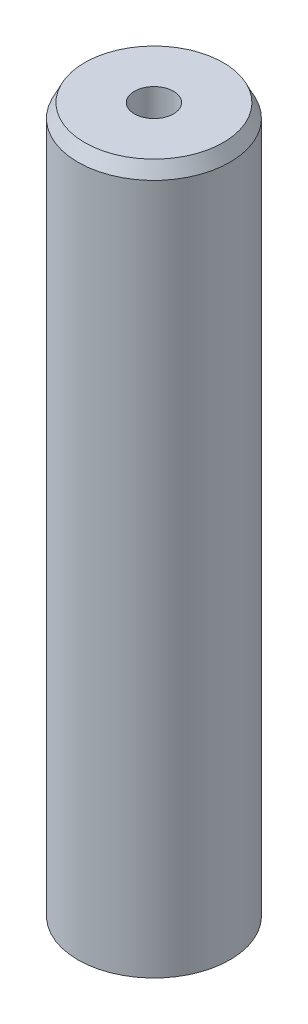
ISO-10303-21;
HEADER;
FILE_DESCRIPTION(('STEP AP214'),'2;1');
FILE_NAME('part.step','',(''),(''),'','','');
FILE_SCHEMA(('AUTOMOTIVE_DESIGN { 1 0 10303 214 1 1 1 1 }'));
ENDSEC;
DATA;
#1=APPLICATION_CONTEXT('core data for automotive mechanical design processes');
#2=APPLICATION_PROTOCOL_DEFINITION('international standard','automotive_design',2000,#1);
#3=PRODUCT_CONTEXT('',#1,'mechanical');
#4=PRODUCT('Part','Part','',(#3));
#5=PRODUCT_RELATED_PRODUCT_CATEGORY('part','',(#4));
#6=PRODUCT_DEFINITION_FORMATION('','',#4);
#7=PRODUCT_DEFINITION_CONTEXT('part definition',#1,'design');
#8=PRODUCT_DEFINITION('design','',#6,#7);
#9=PRODUCT_DEFINITION_SHAPE('','',#8);
#10=(LENGTH_UNIT() NAMED_UNIT(*) SI_UNIT(.MILLI.,.METRE.));
#11=(NAMED_UNIT(*) PLANE_ANGLE_UNIT() SI_UNIT($,.RADIAN.));
#12=(NAMED_UNIT(*) SI_UNIT($,.STERADIAN.) SOLID_ANGLE_UNIT());
#13=UNCERTAINTY_MEASURE_WITH_UNIT(LENGTH_MEASURE(1.E-05),#10,'distance_accuracy_value','');
#14=(GEOMETRIC_REPRESENTATION_CONTEXT(3) GLOBAL_UNCERTAINTY_ASSIGNED_CONTEXT((#13)) GLOBAL_UNIT_ASSIGNED_CONTEXT((#10,
#11,#12)) REPRESENTATION_CONTEXT('',''));
#15=CARTESIAN_POINT('',(0.,0.,0.));
#16=DIRECTION('',(0.,0.,1.));
#17=DIRECTION('',(1.,0.,0.));
#18=AXIS2_PLACEMENT_3D('',#15,#16,#17);
#19=CARTESIAN_POINT('',(0.,93.5188679575843,0.));
#20=DIRECTION('',(0.,-1.,0.));
#21=DIRECTION('',(0.,0.,-1.));
#22=AXIS2_PLACEMENT_3D('',#19,#20,#21);
#23=CYLINDRICAL_SURFACE('',#22,10.);
#24=CARTESIAN_POINT('',(0.,91.723650856446,0.));
#25=DIRECTION('',(0.,1.,0.));
#26=DIRECTION('',(0.,0.,1.));
#27=AXIS2_PLACEMENT_3D('',#24,#25,#26);
#28=CIRCLE('',#27,10.);
#29=CARTESIAN_POINT('',(0.,91.723650856446,10.));
#30=VERTEX_POINT('',#29);
#31=EDGE_CURVE('E50',#30,#30,#28,.F.);
#32=ORIENTED_EDGE('',*,*,#31,.T.);
#33=EDGE_LOOP('',(#32));
#34=FACE_BOUND('',#33,.T.);
#35=CARTESIAN_POINT('',(0.,0.887262560043039,0.));
#36=DIRECTION('',(0.,1.,0.));
#37=DIRECTION('',(0.,0.,1.));
#38=AXIS2_PLACEMENT_3D('',#35,#36,#37);
#39=CIRCLE('',#38,10.);
#40=CARTESIAN_POINT('',(0.,0.887262560043039,10.));
#41=VERTEX_POINT('',#40);
#42=EDGE_CURVE('E51',#41,#41,#39,.T.);
#43=ORIENTED_EDGE('',*,*,#42,.T.);
#44=EDGE_LOOP('',(#43));
#45=FACE_BOUND('',#44,.T.);
#46=ADVANCED_FACE('F39',(#34,#45),#23,.T.);
#47=CARTESIAN_POINT('',(0.,93.5188679575843,0.));
#48=DIRECTION('',(0.,1.,0.));
#49=DIRECTION('',(0.,0.,1.));
#50=AXIS2_PLACEMENT_3D('',#47,#48,#49);
#51=PLANE('',#50);
#52=CARTESIAN_POINT('',(0.,93.5188679575843,0.));
#53=DIRECTION('',(0.,1.,0.));
#54=DIRECTION('',(0.,0.,1.));
#55=AXIS2_PLACEMENT_3D('',#52,#53,#54);
#56=CIRCLE('',#55,9.11273743995698);
#57=CARTESIAN_POINT('',(0.,93.5188679575843,9.11273743995698));
#58=VERTEX_POINT('',#57);
#59=EDGE_CURVE('E54',#58,#58,#56,.T.);
#60=ORIENTED_EDGE('',*,*,#59,.T.);
#61=EDGE_LOOP('',(#60));
#62=FACE_BOUND('',#61,.T.);
#63=CARTESIAN_POINT('',(0.,93.5188679575843,0.));
#64=DIRECTION('',(0.,1.,0.));
#65=DIRECTION('',(0.,0.,1.));
#66=AXIS2_PLACEMENT_3D('',#63,#64,#65);
#67=CIRCLE('',#66,2.57745682731033);
#68=CARTESIAN_POINT('',(0.,93.5188679575843,2.57745682731033));
#69=VERTEX_POINT('',#68);
#70=EDGE_CURVE('E58',#69,#69,#67,.T.);
#71=ORIENTED_EDGE('',*,*,#70,.F.);
#72=EDGE_LOOP('',(#71));
#73=FACE_BOUND('',#72,.T.);
#74=ADVANCED_FACE('F69',(#62,#73),#51,.T.);
#75=CARTESIAN_POINT('',(0.,0.,0.));
#76=DIRECTION('',(0.,1.,0.));
#77=DIRECTION('',(0.,0.,1.));
#78=AXIS2_PLACEMENT_3D('',#75,#76,#77);
#79=PLANE('',#78);
#80=CARTESIAN_POINT('',(0.,0.,0.));
#81=DIRECTION('',(0.,1.,0.));
#82=DIRECTION('',(0.,0.,1.));
#83=AXIS2_PLACEMENT_3D('',#80,#81,#82);
#84=CIRCLE('',#83,8.20478289886163);
#85=CARTESIAN_POINT('',(0.,0.,8.20478289886163));
#86=VERTEX_POINT('',#85);
#87=EDGE_CURVE('E10',#86,#86,#84,.F.);
#88=ORIENTED_EDGE('',*,*,#87,.T.);
#89=EDGE_LOOP('',(#88));
#90=FACE_BOUND('',#89,.T.);
#91=CARTESIAN_POINT('',(0.,0.,0.));
#92=DIRECTION('',(0.,1.,0.));
#93=DIRECTION('',(0.,0.,1.));
#94=AXIS2_PLACEMENT_3D('',#91,#92,#93);
#95=CIRCLE('',#94,2.57745682731033);
#96=CARTESIAN_POINT('',(0.,0.,2.57745682731033));
#97=VERTEX_POINT('',#96);
#98=EDGE_CURVE('E63',#97,#97,#95,.T.);
#99=ORIENTED_EDGE('',*,*,#98,.T.);
#100=EDGE_LOOP('',(#99));
#101=FACE_BOUND('',#100,.T.);
#102=ADVANCED_FACE('F75',(#90,#101),#79,.F.);
#103=CARTESIAN_POINT('',(0.,93.5188679575843,0.));
#104=DIRECTION('',(0.,-1.,0.));
#105=DIRECTION('',(0.,0.,-1.));
#106=AXIS2_PLACEMENT_3D('',#103,#104,#105);
#107=CYLINDRICAL_SURFACE('',#106,2.57745682731033);
#108=ORIENTED_EDGE('',*,*,#70,.T.);
#109=EDGE_LOOP('',(#108));
#110=FACE_BOUND('',#109,.T.);
#111=ORIENTED_EDGE('',*,*,#98,.F.);
#112=EDGE_LOOP('',(#111));
#113=FACE_BOUND('',#112,.T.);
#114=ADVANCED_FACE('F70',(#110,#113),#107,.F.);
#115=CARTESIAN_POINT('',(0.,93.5188679575843,0.));
#116=DIRECTION('',(0.,-1.,0.));
#117=DIRECTION('',(0.,0.,-1.));
#118=AXIS2_PLACEMENT_3D('',#115,#116,#117);
#119=CONICAL_SURFACE('',#118,9.11273743995698,0.459026520333633);
#120=ORIENTED_EDGE('',*,*,#31,.F.);
#121=EDGE_LOOP('',(#120));
#122=FACE_BOUND('',#121,.T.);
#123=ORIENTED_EDGE('',*,*,#59,.F.);
#124=EDGE_LOOP('',(#123));
#125=FACE_BOUND('',#124,.T.);
#126=ADVANCED_FACE('F81',(#122,#125),#119,.T.);
#127=CARTESIAN_POINT('',(0.,0.887262560043039,0.));
#128=DIRECTION('',(0.,1.,0.));
#129=DIRECTION('',(0.,0.,1.));
#130=AXIS2_PLACEMENT_3D('',#127,#128,#129);
#131=CONICAL_SURFACE('',#130,10.,1.11176980646126);
#132=ORIENTED_EDGE('',*,*,#87,.F.);
#133=EDGE_LOOP('',(#132));
#134=FACE_BOUND('',#133,.T.);
#135=ORIENTED_EDGE('',*,*,#42,.F.);
#136=EDGE_LOOP('',(#135));
#137=FACE_BOUND('',#136,.T.);
#138=ADVANCED_FACE('F45',(#134,#137),#131,.T.);
#139=CLOSED_SHELL('',(#46,#74,#102,#114,#126,#138));
#140=MANIFOLD_SOLID_BREP('B2',#139);
#141=ADVANCED_BREP_SHAPE_REPRESENTATION('',(#18,#140),#14);
#142=SHAPE_DEFINITION_REPRESENTATION(#9,#141);
ENDSEC;
END-ISO-10303-21;
